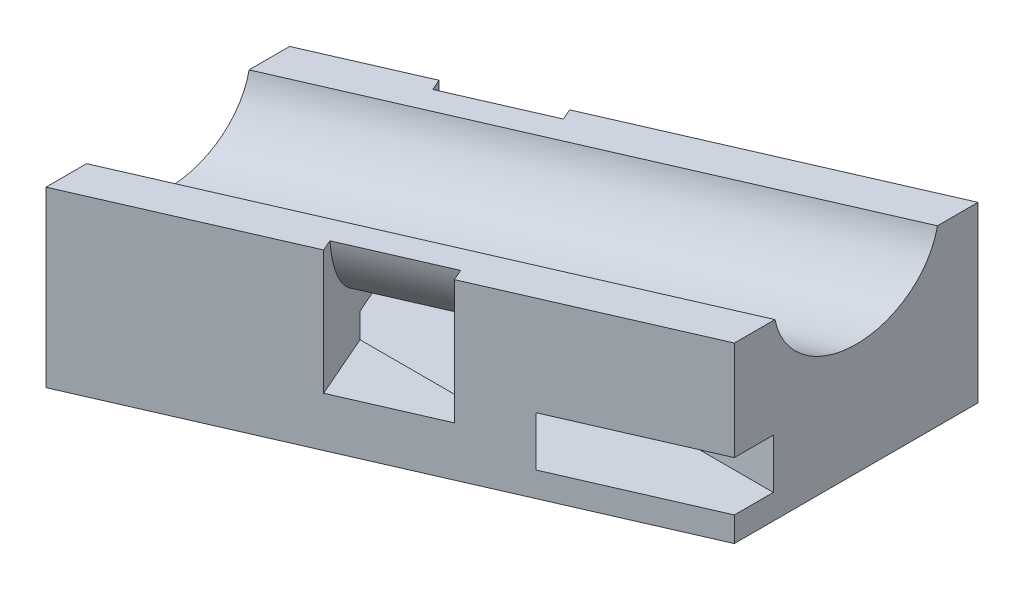
ISO-10303-21;
HEADER;
FILE_DESCRIPTION(('STEP AP214'),'2;1');
FILE_NAME('part.step','',(''),(''),'','','');
FILE_SCHEMA(('AUTOMOTIVE_DESIGN { 1 0 10303 214 1 1 1 1 }'));
ENDSEC;
DATA;
#1=APPLICATION_CONTEXT('core data for automotive mechanical design processes');
#2=APPLICATION_PROTOCOL_DEFINITION('international standard','automotive_design',2000,#1);
#3=PRODUCT_CONTEXT('',#1,'mechanical');
#4=PRODUCT('Part','Part','',(#3));
#5=PRODUCT_RELATED_PRODUCT_CATEGORY('part','',(#4));
#6=PRODUCT_DEFINITION_FORMATION('','',#4);
#7=PRODUCT_DEFINITION_CONTEXT('part definition',#1,'design');
#8=PRODUCT_DEFINITION('design','',#6,#7);
#9=PRODUCT_DEFINITION_SHAPE('','',#8);
#10=(LENGTH_UNIT() NAMED_UNIT(*) SI_UNIT(.MILLI.,.METRE.));
#11=(NAMED_UNIT(*) PLANE_ANGLE_UNIT() SI_UNIT($,.RADIAN.));
#12=(NAMED_UNIT(*) SI_UNIT($,.STERADIAN.) SOLID_ANGLE_UNIT());
#13=UNCERTAINTY_MEASURE_WITH_UNIT(LENGTH_MEASURE(1.E-05),#10,'distance_accuracy_value','');
#14=(GEOMETRIC_REPRESENTATION_CONTEXT(3) GLOBAL_UNCERTAINTY_ASSIGNED_CONTEXT((#13)) GLOBAL_UNIT_ASSIGNED_CONTEXT((#10,
#11,#12)) REPRESENTATION_CONTEXT('',''));
#15=CARTESIAN_POINT('',(0.,0.,0.));
#16=DIRECTION('',(0.,0.,1.));
#17=DIRECTION('',(1.,0.,0.));
#18=AXIS2_PLACEMENT_3D('',#15,#16,#17);
#19=CARTESIAN_POINT('',(0.,7.,0.));
#20=DIRECTION('',(0.,-1.,0.));
#21=DIRECTION('',(0.,0.,-1.));
#22=AXIS2_PLACEMENT_3D('',#19,#20,#21);
#23=PLANE('',#22);
#24=DIRECTION('',(0.,0.,-1.));
#25=VECTOR('',#24,1.);
#26=CARTESIAN_POINT('',(0.,7.,0.));
#27=LINE('',#26,#25);
#28=CARTESIAN_POINT('',(0.,7.,0.));
#29=VERTEX_POINT('',#28);
#30=CARTESIAN_POINT('',(0.,7.,-1.63663417676994));
#31=VERTEX_POINT('',#30);
#32=EDGE_CURVE('E182',#29,#31,#27,.T.);
#33=ORIENTED_EDGE('',*,*,#32,.F.);
#34=DIRECTION('',(0.916515138991168,0.,-0.4));
#35=VECTOR('',#34,1.);
#36=CARTESIAN_POINT('',(22.9128784747792,7.,-10.));
#37=LINE('',#36,#35);
#38=CARTESIAN_POINT('',(7.79037868142493,7.,-3.40000000000001));
#39=VERTEX_POINT('',#38);
#40=EDGE_CURVE('E197',#29,#39,#37,.T.);
#41=ORIENTED_EDGE('',*,*,#40,.T.);
#42=DIRECTION('',(0.4,0.,0.916515138991168));
#43=VECTOR('',#42,1.);
#44=CARTESIAN_POINT('',(7.59537089324404,7.,-3.84681897522243));
#45=LINE('',#44,#43);
#46=CARTESIAN_POINT('',(7.59537089324404,7.,-3.84681897522243));
#47=VERTEX_POINT('',#46);
#48=EDGE_CURVE('E297',#47,#39,#45,.T.);
#49=ORIENTED_EDGE('',*,*,#48,.F.);
#50=DIRECTION('',(0.916515138991168,0.,-0.4));
#51=VECTOR('',#50,1.);
#52=CARTESIAN_POINT('',(7.59537089324404,7.,-3.84681897522243));
#53=LINE('',#52,#51);
#54=CARTESIAN_POINT('',(11.2614314492087,7.,-5.44681897522243));
#55=VERTEX_POINT('',#54);
#56=EDGE_CURVE('E310',#47,#55,#53,.T.);
#57=ORIENTED_EDGE('',*,*,#56,.T.);
#58=DIRECTION('',(0.4,0.,0.916515138991168));
#59=VECTOR('',#58,1.);
#60=CARTESIAN_POINT('',(11.2614314492087,7.,-5.44681897522243));
#61=LINE('',#60,#59);
#62=CARTESIAN_POINT('',(11.4564392373896,7.,-5.00000000000001));
#63=VERTEX_POINT('',#62);
#64=EDGE_CURVE('E313',#55,#63,#61,.T.);
#65=ORIENTED_EDGE('',*,*,#64,.T.);
#66=CARTESIAN_POINT('',(19.3128784747792,7.,-8.42883119030086));
#67=VERTEX_POINT('',#66);
#68=EDGE_CURVE('E210',#63,#67,#37,.T.);
#69=ORIENTED_EDGE('',*,*,#68,.T.);
#70=DIRECTION('',(0.,0.,1.));
#71=VECTOR('',#70,1.);
#72=CARTESIAN_POINT('',(19.3128784747792,7.,-18.2486362509205));
#73=LINE('',#72,#71);
#74=CARTESIAN_POINT('',(19.3128784747792,7.,-10.0654653670708));
#75=VERTEX_POINT('',#74);
#76=EDGE_CURVE('E363',#75,#67,#73,.T.);
#77=ORIENTED_EDGE('',*,*,#76,.F.);
#78=DIRECTION('',(-0.916515138991168,0.,0.4));
#79=VECTOR('',#78,1.);
#80=CARTESIAN_POINT('',(28.2702268782218,7.,-13.9747727084868));
#81=LINE('',#80,#79);
#82=EDGE_CURVE('E200',#75,#31,#81,.T.);
#83=ORIENTED_EDGE('',*,*,#82,.T.);
#84=EDGE_LOOP('',(#33,#41,#49,#57,#65,#69,#77,#83));
#85=FACE_BOUND('',#84,.T.);
#86=ADVANCED_FACE('F33',(#85),#23,.F.);
#87=CARTESIAN_POINT('',(0.,7.,-8.18317088384971));
#88=VERTEX_POINT('',#87);
#89=CARTESIAN_POINT('',(0.,7.,-9.81980506061964));
#90=VERTEX_POINT('',#89);
#91=EDGE_CURVE('E202',#88,#90,#27,.T.);
#92=ORIENTED_EDGE('',*,*,#91,.F.);
#93=DIRECTION('',(-0.916515138991168,0.,0.4));
#94=VECTOR('',#93,1.);
#95=CARTESIAN_POINT('',(25.8702268782218,7.,-19.4738635424338));
#96=LINE('',#95,#94);
#97=CARTESIAN_POINT('',(19.3128784747792,7.,-16.6120020741506));
#98=VERTEX_POINT('',#97);
#99=EDGE_CURVE('E222',#98,#88,#96,.T.);
#100=ORIENTED_EDGE('',*,*,#99,.F.);
#101=CARTESIAN_POINT('',(19.3128784747792,7.,-18.2486362509205));
#102=VERTEX_POINT('',#101);
#103=EDGE_CURVE('E348',#102,#98,#73,.T.);
#104=ORIENTED_EDGE('',*,*,#103,.F.);
#105=DIRECTION('',(-0.916515138991168,0.,0.4));
#106=VECTOR('',#105,1.);
#107=CARTESIAN_POINT('',(-3.6,7.,-8.2486362509205));
#108=LINE('',#107,#106);
#109=CARTESIAN_POINT('',(7.85643923738961,7.,-13.2486362509205));
#110=VERTEX_POINT('',#109);
#111=EDGE_CURVE('E191',#102,#110,#108,.T.);
#112=ORIENTED_EDGE('',*,*,#111,.T.);
#113=DIRECTION('',(0.400000000000001,0.,0.916515138991168));
#114=VECTOR('',#113,1.);
#115=CARTESIAN_POINT('',(8.05144702557049,7.,-12.8018172756981));
#116=LINE('',#115,#114);
#117=CARTESIAN_POINT('',(8.05144702557049,7.,-12.8018172756981));
#118=VERTEX_POINT('',#117);
#119=EDGE_CURVE('E298',#110,#118,#116,.T.);
#120=ORIENTED_EDGE('',*,*,#119,.T.);
#121=DIRECTION('',(0.916515138991168,0.,-0.4));
#122=VECTOR('',#121,1.);
#123=CARTESIAN_POINT('',(4.38538646960582,7.,-11.2018172756981));
#124=LINE('',#123,#122);
#125=CARTESIAN_POINT('',(4.38538646960582,7.,-11.2018172756981));
#126=VERTEX_POINT('',#125);
#127=EDGE_CURVE('E328',#126,#118,#124,.T.);
#128=ORIENTED_EDGE('',*,*,#127,.F.);
#129=DIRECTION('',(0.400000000000001,0.,0.916515138991168));
#130=VECTOR('',#129,1.);
#131=CARTESIAN_POINT('',(4.38538646960582,7.,-11.2018172756981));
#132=LINE('',#131,#130);
#133=CARTESIAN_POINT('',(4.19037868142494,7.,-11.6486362509205));
#134=VERTEX_POINT('',#133);
#135=EDGE_CURVE('E307',#134,#126,#132,.T.);
#136=ORIENTED_EDGE('',*,*,#135,.F.);
#137=EDGE_CURVE('E209',#134,#90,#108,.T.);
#138=ORIENTED_EDGE('',*,*,#137,.T.);
#139=EDGE_LOOP('',(#92,#100,#104,#112,#120,#128,#136,#138));
#140=FACE_BOUND('',#139,.T.);
#141=ADVANCED_FACE('F347',(#140),#23,.F.);
#142=CARTESIAN_POINT('',(0.,0.,0.));
#143=DIRECTION('',(0.,-1.,0.));
#144=DIRECTION('',(0.,0.,-1.));
#145=AXIS2_PLACEMENT_3D('',#142,#143,#144);
#146=PLANE('',#145);
#147=DIRECTION('',(0.916515138991168,0.,-0.4));
#148=VECTOR('',#147,1.);
#149=CARTESIAN_POINT('',(22.9128784747792,0.,-10.));
#150=LINE('',#149,#148);
#151=CARTESIAN_POINT('',(0.,0.,0.));
#152=VERTEX_POINT('',#151);
#153=CARTESIAN_POINT('',(19.3128784747792,0.,-8.42883119030086));
#154=VERTEX_POINT('',#153);
#155=EDGE_CURVE('E220',#152,#154,#150,.T.);
#156=ORIENTED_EDGE('',*,*,#155,.F.);
#157=DIRECTION('',(0.,0.,-1.));
#158=VECTOR('',#157,1.);
#159=CARTESIAN_POINT('',(0.,0.,0.));
#160=LINE('',#159,#158);
#161=CARTESIAN_POINT('',(0.,0.,-9.81980506061964));
#162=VERTEX_POINT('',#161);
#163=EDGE_CURVE('E185',#152,#162,#160,.T.);
#164=ORIENTED_EDGE('',*,*,#163,.T.);
#165=DIRECTION('',(-0.916515138991168,0.,0.4));
#166=VECTOR('',#165,1.);
#167=CARTESIAN_POINT('',(-3.6,0.,-8.2486362509205));
#168=LINE('',#167,#166);
#169=CARTESIAN_POINT('',(19.3128784747792,0.,-18.2486362509205));
#170=VERTEX_POINT('',#169);
#171=EDGE_CURVE('E215',#170,#162,#168,.T.);
#172=ORIENTED_EDGE('',*,*,#171,.F.);
#173=DIRECTION('',(0.,0.,1.));
#174=VECTOR('',#173,1.);
#175=CARTESIAN_POINT('',(19.3128784747792,0.,-18.2486362509205));
#176=LINE('',#175,#174);
#177=EDGE_CURVE('E360',#170,#154,#176,.T.);
#178=ORIENTED_EDGE('',*,*,#177,.T.);
#179=EDGE_LOOP('',(#156,#164,#172,#178));
#180=FACE_BOUND('',#179,.T.);
#181=ADVANCED_FACE('F400',(#180),#146,.T.);
#182=CARTESIAN_POINT('',(27.0702268782218,7.54999999999999,-16.7243181254603));
#183=DIRECTION('',(-0.916515138991168,0.,0.4));
#184=DIRECTION('',(0.4,0.,0.916515138991168));
#185=AXIS2_PLACEMENT_3D('',#182,#183,#184);
#186=CYLINDRICAL_SURFACE('',#185,3.04999999999999);
#187=CARTESIAN_POINT('',(0.,7.54999999999999,-4.90990253030982));
#188=DIRECTION('',(-1.,0.,0.));
#189=DIRECTION('',(0.,0.,1.));
#190=AXIS2_PLACEMENT_3D('',#187,#188,#189);
#191=ELLIPSE('',#190,3.32782282609888,3.04999999999999);
#192=EDGE_CURVE('E343',#31,#88,#191,.F.);
#193=ORIENTED_EDGE('',*,*,#192,.F.);
#194=ORIENTED_EDGE('',*,*,#82,.F.);
#195=CARTESIAN_POINT('',(19.3128784747792,7.54999999999999,-13.3387337206107));
#196=DIRECTION('',(1.,0.,0.));
#197=DIRECTION('',(0.,0.,1.));
#198=AXIS2_PLACEMENT_3D('',#195,#196,#197);
#199=ELLIPSE('',#198,3.32782282609888,3.04999999999999);
#200=EDGE_CURVE('E249',#98,#75,#199,.F.);
#201=ORIENTED_EDGE('',*,*,#200,.F.);
#202=ORIENTED_EDGE('',*,*,#99,.T.);
#203=EDGE_LOOP('',(#193,#194,#201,#202));
#204=FACE_BOUND('',#203,.T.);
#205=ADVANCED_FACE('F342',(#204),#186,.F.);
#206=CARTESIAN_POINT('',(-3.6,1.,-6.));
#207=DIRECTION('',(0.,-1.,0.));
#208=DIRECTION('',(0.,0.,-1.));
#209=AXIS2_PLACEMENT_3D('',#206,#207,#208);
#210=PLANE('',#209);
#211=DIRECTION('',(0.,0.,-1.));
#212=VECTOR('',#211,1.);
#213=CARTESIAN_POINT('',(0.,1.,-6.));
#214=LINE('',#213,#212);
#215=CARTESIAN_POINT('',(0.,1.,-6.));
#216=VERTEX_POINT('',#215);
#217=CARTESIAN_POINT('',(0.,1.,-9.81980506061964));
#218=VERTEX_POINT('',#217);
#219=EDGE_CURVE('E357',#216,#218,#214,.T.);
#220=ORIENTED_EDGE('',*,*,#219,.F.);
#221=DIRECTION('',(1.,0.,0.));
#222=VECTOR('',#221,1.);
#223=CARTESIAN_POINT('',(-3.6,1.,-6.));
#224=LINE('',#223,#222);
#225=CARTESIAN_POINT('',(13.7477270848675,1.,-6.));
#226=VERTEX_POINT('',#225);
#227=EDGE_CURVE('E257',#216,#226,#224,.T.);
#228=ORIENTED_EDGE('',*,*,#227,.T.);
#229=DIRECTION('',(-0.916515138991168,0.,0.4));
#230=VECTOR('',#229,1.);
#231=CARTESIAN_POINT('',(22.9128784747792,1.,-10.));
#232=LINE('',#231,#230);
#233=CARTESIAN_POINT('',(19.3128784747792,1.,-8.42883119030086));
#234=VERTEX_POINT('',#233);
#235=EDGE_CURVE('E248',#234,#226,#232,.T.);
#236=ORIENTED_EDGE('',*,*,#235,.F.);
#237=DIRECTION('',(0.,0.,1.));
#238=VECTOR('',#237,1.);
#239=CARTESIAN_POINT('',(19.3128784747792,1.,-6.));
#240=LINE('',#239,#238);
#241=CARTESIAN_POINT('',(19.3128784747792,1.,-10.));
#242=VERTEX_POINT('',#241);
#243=EDGE_CURVE('E235',#242,#234,#240,.T.);
#244=ORIENTED_EDGE('',*,*,#243,.F.);
#245=DIRECTION('',(1.,0.,0.));
#246=VECTOR('',#245,1.);
#247=CARTESIAN_POINT('',(-3.6,1.,-10.));
#248=LINE('',#247,#246);
#249=CARTESIAN_POINT('',(0.412878474779229,1.,-10.));
#250=VERTEX_POINT('',#249);
#251=EDGE_CURVE('E246',#250,#242,#248,.T.);
#252=ORIENTED_EDGE('',*,*,#251,.F.);
#253=DIRECTION('',(0.916515138991168,0.,-0.4));
#254=VECTOR('',#253,1.);
#255=CARTESIAN_POINT('',(-3.6,0.999999999999999,-8.2486362509205));
#256=LINE('',#255,#254);
#257=EDGE_CURVE('E290',#218,#250,#256,.T.);
#258=ORIENTED_EDGE('',*,*,#257,.F.);
#259=EDGE_LOOP('',(#220,#228,#236,#244,#252,#258));
#260=FACE_BOUND('',#259,.T.);
#261=ADVANCED_FACE('F244',(#260),#210,.F.);
#262=CARTESIAN_POINT('',(-3.6,7.,-8.2486362509205));
#263=DIRECTION('',(0.4,0.,0.916515138991168));
#264=DIRECTION('',(0.916515138991168,0.,-0.4));
#265=AXIS2_PLACEMENT_3D('',#262,#263,#264);
#266=PLANE('',#265);
#267=DIRECTION('',(0.,-1.,0.));
#268=VECTOR('',#267,1.);
#269=CARTESIAN_POINT('',(0.,7.,-9.81980506061964));
#270=LINE('',#269,#268);
#271=CARTESIAN_POINT('',(0.,3.,-9.81980506061964));
#272=VERTEX_POINT('',#271);
#273=EDGE_CURVE('E47',#90,#272,#270,.T.);
#274=ORIENTED_EDGE('',*,*,#273,.F.);
#275=ORIENTED_EDGE('',*,*,#137,.F.);
#276=DIRECTION('',(0.,1.,0.));
#277=VECTOR('',#276,1.);
#278=CARTESIAN_POINT('',(4.19037868142494,7.,-11.6486362509205));
#279=LINE('',#278,#277);
#280=CARTESIAN_POINT('',(4.19037868142494,1.99999999999999,-11.6486362509205));
#281=VERTEX_POINT('',#280);
#282=EDGE_CURVE('E305',#281,#134,#279,.T.);
#283=ORIENTED_EDGE('',*,*,#282,.F.);
#284=DIRECTION('',(0.916515138991168,0.,-0.4));
#285=VECTOR('',#284,1.);
#286=CARTESIAN_POINT('',(4.19037868142494,1.99999999999999,-11.6486362509205));
#287=LINE('',#286,#285);
#288=CARTESIAN_POINT('',(7.85643923738961,1.99999999999999,-13.2486362509205));
#289=VERTEX_POINT('',#288);
#290=EDGE_CURVE('E331',#281,#289,#287,.T.);
#291=ORIENTED_EDGE('',*,*,#290,.T.);
#292=DIRECTION('',(0.,1.,0.));
#293=VECTOR('',#292,1.);
#294=CARTESIAN_POINT('',(7.85643923738961,7.,-13.2486362509205));
#295=LINE('',#294,#293);
#296=EDGE_CURVE('E323',#289,#110,#295,.T.);
#297=ORIENTED_EDGE('',*,*,#296,.T.);
#298=ORIENTED_EDGE('',*,*,#111,.F.);
#299=DIRECTION('',(0.,-1.,0.));
#300=VECTOR('',#299,1.);
#301=CARTESIAN_POINT('',(19.3128784747792,7.,-18.2486362509205));
#302=LINE('',#301,#300);
#303=EDGE_CURVE('E190',#102,#170,#302,.T.);
#304=ORIENTED_EDGE('',*,*,#303,.T.);
#305=ORIENTED_EDGE('',*,*,#171,.T.);
#306=EDGE_CURVE('E201',#218,#162,#270,.T.);
#307=ORIENTED_EDGE('',*,*,#306,.F.);
#308=ORIENTED_EDGE('',*,*,#257,.T.);
#309=DIRECTION('',(0.,1.,0.));
#310=VECTOR('',#309,1.);
#311=CARTESIAN_POINT('',(0.412878474779228,7.,-10.));
#312=LINE('',#311,#310);
#313=CARTESIAN_POINT('',(0.412878474779227,3.,-10.));
#314=VERTEX_POINT('',#313);
#315=EDGE_CURVE('E255',#250,#314,#312,.T.);
#316=ORIENTED_EDGE('',*,*,#315,.T.);
#317=DIRECTION('',(-0.916515138991168,0.,0.4));
#318=VECTOR('',#317,1.);
#319=CARTESIAN_POINT('',(-3.6,3.,-8.2486362509205));
#320=LINE('',#319,#318);
#321=EDGE_CURVE('E275',#314,#272,#320,.T.);
#322=ORIENTED_EDGE('',*,*,#321,.T.);
#323=EDGE_LOOP('',(#274,#275,#283,#291,#297,#298,#304,#305,#307,#308,#316,#322));
#324=FACE_BOUND('',#323,.T.);
#325=ADVANCED_FACE('F397',(#324),#266,.F.);
#326=CARTESIAN_POINT('',(-3.6,1.,-6.));
#327=DIRECTION('',(0.,0.,1.));
#328=DIRECTION('',(1.,0.,0.));
#329=AXIS2_PLACEMENT_3D('',#326,#327,#328);
#330=PLANE('',#329);
#331=DIRECTION('',(0.,-1.,0.));
#332=VECTOR('',#331,1.);
#333=CARTESIAN_POINT('',(0.,1.,-6.));
#334=LINE('',#333,#332);
#335=CARTESIAN_POINT('',(0.,3.,-6.));
#336=VERTEX_POINT('',#335);
#337=EDGE_CURVE('E355',#336,#216,#334,.T.);
#338=ORIENTED_EDGE('',*,*,#337,.F.);
#339=DIRECTION('',(1.,0.,0.));
#340=VECTOR('',#339,1.);
#341=CARTESIAN_POINT('',(-3.6,3.,-6.));
#342=LINE('',#341,#340);
#343=CARTESIAN_POINT('',(6.65564565219777,3.,-6.));
#344=VERTEX_POINT('',#343);
#345=EDGE_CURVE('E268',#336,#344,#342,.T.);
#346=ORIENTED_EDGE('',*,*,#345,.T.);
#347=DIRECTION('',(0.,1.,0.));
#348=VECTOR('',#347,1.);
#349=CARTESIAN_POINT('',(6.65564565219777,7.54999999999999,-6.));
#350=LINE('',#349,#348);
#351=CARTESIAN_POINT('',(6.65564565219777,1.99999999999999,-6.));
#352=VERTEX_POINT('',#351);
#353=EDGE_CURVE('E284',#352,#344,#350,.T.);
#354=ORIENTED_EDGE('',*,*,#353,.F.);
#355=DIRECTION('',(-1.,0.,0.));
#356=VECTOR('',#355,1.);
#357=CARTESIAN_POINT('',(7.79037868142493,1.99999999999999,-6.));
#358=LINE('',#357,#356);
#359=CARTESIAN_POINT('',(11.0200034569176,1.99999999999999,-6.));
#360=VERTEX_POINT('',#359);
#361=EDGE_CURVE('E281',#360,#352,#358,.T.);
#362=ORIENTED_EDGE('',*,*,#361,.F.);
#363=DIRECTION('',(0.,1.,0.));
#364=VECTOR('',#363,1.);
#365=CARTESIAN_POINT('',(11.0200034569176,7.54999999999999,-6.));
#366=LINE('',#365,#364);
#367=CARTESIAN_POINT('',(11.0200034569176,3.,-6.));
#368=VERTEX_POINT('',#367);
#369=EDGE_CURVE('E232',#360,#368,#366,.T.);
#370=ORIENTED_EDGE('',*,*,#369,.T.);
#371=CARTESIAN_POINT('',(13.7477270848675,3.,-6.));
#372=VERTEX_POINT('',#371);
#373=EDGE_CURVE('E369',#368,#372,#342,.T.);
#374=ORIENTED_EDGE('',*,*,#373,.T.);
#375=DIRECTION('',(0.,1.,0.));
#376=VECTOR('',#375,1.);
#377=CARTESIAN_POINT('',(13.7477270848675,7.,-6.));
#378=LINE('',#377,#376);
#379=EDGE_CURVE('E287',#226,#372,#378,.T.);
#380=ORIENTED_EDGE('',*,*,#379,.F.);
#381=ORIENTED_EDGE('',*,*,#227,.F.);
#382=EDGE_LOOP('',(#338,#346,#354,#362,#370,#374,#380,#381));
#383=FACE_BOUND('',#382,.T.);
#384=ADVANCED_FACE('F383',(#383),#330,.F.);
#385=CARTESIAN_POINT('',(-3.6,3.,-6.));
#386=DIRECTION('',(0.,1.,0.));
#387=DIRECTION('',(0.,0.,1.));
#388=AXIS2_PLACEMENT_3D('',#385,#386,#387);
#389=PLANE('',#388);
#390=DIRECTION('',(0.,0.,1.));
#391=VECTOR('',#390,1.);
#392=CARTESIAN_POINT('',(0.,3.,-6.));
#393=LINE('',#392,#391);
#394=EDGE_CURVE('E11',#272,#336,#393,.T.);
#395=ORIENTED_EDGE('',*,*,#394,.F.);
#396=ORIENTED_EDGE('',*,*,#321,.F.);
#397=DIRECTION('',(1.,0.,0.));
#398=VECTOR('',#397,1.);
#399=CARTESIAN_POINT('',(-3.6,3.,-10.));
#400=LINE('',#399,#398);
#401=CARTESIAN_POINT('',(4.90990253030983,3.,-10.));
#402=VERTEX_POINT('',#401);
#403=EDGE_CURVE('E259',#314,#402,#400,.T.);
#404=ORIENTED_EDGE('',*,*,#403,.T.);
#405=DIRECTION('',(-0.4,0.,-0.916515138991168));
#406=VECTOR('',#405,1.);
#407=CARTESIAN_POINT('',(5.99037868142493,3.,-7.52431812546026));
#408=LINE('',#407,#406);
#409=EDGE_CURVE('E272',#344,#402,#408,.T.);
#410=ORIENTED_EDGE('',*,*,#409,.F.);
#411=ORIENTED_EDGE('',*,*,#345,.F.);
#412=EDGE_LOOP('',(#395,#396,#404,#410,#411));
#413=FACE_BOUND('',#412,.T.);
#414=ADVANCED_FACE('F377',(#413),#389,.F.);
#415=CARTESIAN_POINT('',(22.9128784747792,7.,-10.));
#416=DIRECTION('',(-0.4,0.,-0.916515138991168));
#417=DIRECTION('',(-0.916515138991168,0.,0.4));
#418=AXIS2_PLACEMENT_3D('',#415,#416,#417);
#419=PLANE('',#418);
#420=DIRECTION('',(0.,-1.,0.));
#421=VECTOR('',#420,1.);
#422=CARTESIAN_POINT('',(19.3128784747792,7.,-8.42883119030086));
#423=LINE('',#422,#421);
#424=CARTESIAN_POINT('',(19.3128784747792,3.,-8.42883119030086));
#425=VERTEX_POINT('',#424);
#426=EDGE_CURVE('E366',#67,#425,#423,.T.);
#427=ORIENTED_EDGE('',*,*,#426,.F.);
#428=ORIENTED_EDGE('',*,*,#68,.F.);
#429=DIRECTION('',(0.,-1.,0.));
#430=VECTOR('',#429,1.);
#431=CARTESIAN_POINT('',(11.4564392373896,7.,-5.00000000000001));
#432=LINE('',#431,#430);
#433=CARTESIAN_POINT('',(11.4564392373896,1.99999999999999,-5.));
#434=VERTEX_POINT('',#433);
#435=EDGE_CURVE('E316',#63,#434,#432,.T.);
#436=ORIENTED_EDGE('',*,*,#435,.T.);
#437=DIRECTION('',(0.916515138991168,0.,-0.4));
#438=VECTOR('',#437,1.);
#439=CARTESIAN_POINT('',(7.79037868142493,1.99999999999999,-3.40000000000001));
#440=LINE('',#439,#438);
#441=CARTESIAN_POINT('',(7.79037868142493,1.99999999999999,-3.40000000000001));
#442=VERTEX_POINT('',#441);
#443=EDGE_CURVE('E334',#442,#434,#440,.T.);
#444=ORIENTED_EDGE('',*,*,#443,.F.);
#445=DIRECTION('',(0.,-1.,0.));
#446=VECTOR('',#445,1.);
#447=CARTESIAN_POINT('',(7.79037868142493,7.,-3.40000000000001));
#448=LINE('',#447,#446);
#449=EDGE_CURVE('E208',#39,#442,#448,.T.);
#450=ORIENTED_EDGE('',*,*,#449,.F.);
#451=ORIENTED_EDGE('',*,*,#40,.F.);
#452=DIRECTION('',(0.,-1.,0.));
#453=VECTOR('',#452,1.);
#454=CARTESIAN_POINT('',(0.,7.,0.));
#455=LINE('',#454,#453);
#456=EDGE_CURVE('E179',#29,#152,#455,.T.);
#457=ORIENTED_EDGE('',*,*,#456,.T.);
#458=ORIENTED_EDGE('',*,*,#155,.T.);
#459=EDGE_CURVE('E362',#234,#154,#423,.T.);
#460=ORIENTED_EDGE('',*,*,#459,.F.);
#461=ORIENTED_EDGE('',*,*,#235,.T.);
#462=ORIENTED_EDGE('',*,*,#379,.T.);
#463=DIRECTION('',(0.916515138991168,0.,-0.4));
#464=VECTOR('',#463,1.);
#465=CARTESIAN_POINT('',(22.9128784747792,3.,-10.));
#466=LINE('',#465,#464);
#467=EDGE_CURVE('E278',#372,#425,#466,.T.);
#468=ORIENTED_EDGE('',*,*,#467,.T.);
#469=EDGE_LOOP('',(#427,#428,#436,#444,#450,#451,#457,#458,#460,#461,#462,#468));
#470=FACE_BOUND('',#469,.T.);
#471=ADVANCED_FACE('F35',(#470),#419,.F.);
#472=DIRECTION('',(0.,0.,-1.));
#473=VECTOR('',#472,1.);
#474=CARTESIAN_POINT('',(19.3128784747792,3.,-6.));
#475=LINE('',#474,#473);
#476=CARTESIAN_POINT('',(19.3128784747792,3.,-10.));
#477=VERTEX_POINT('',#476);
#478=EDGE_CURVE('E55',#425,#477,#475,.T.);
#479=ORIENTED_EDGE('',*,*,#478,.F.);
#480=ORIENTED_EDGE('',*,*,#467,.F.);
#481=ORIENTED_EDGE('',*,*,#373,.F.);
#482=DIRECTION('',(-0.4,0.,-0.916515138991168));
#483=VECTOR('',#482,1.);
#484=CARTESIAN_POINT('',(9.6564392373896,3.,-9.12431812546026));
#485=LINE('',#484,#483);
#486=CARTESIAN_POINT('',(9.27426033502968,3.,-10.));
#487=VERTEX_POINT('',#486);
#488=EDGE_CURVE('E229',#368,#487,#485,.T.);
#489=ORIENTED_EDGE('',*,*,#488,.T.);
#490=EDGE_CURVE('E256',#487,#477,#400,.T.);
#491=ORIENTED_EDGE('',*,*,#490,.T.);
#492=EDGE_LOOP('',(#479,#480,#481,#489,#491));
#493=FACE_BOUND('',#492,.T.);
#494=ADVANCED_FACE('F392',(#493),#389,.F.);
#495=CARTESIAN_POINT('',(-3.6,1.,-10.));
#496=DIRECTION('',(0.,0.,-1.));
#497=DIRECTION('',(-1.,0.,0.));
#498=AXIS2_PLACEMENT_3D('',#495,#496,#497);
#499=PLANE('',#498);
#500=DIRECTION('',(0.,-1.,0.));
#501=VECTOR('',#500,1.);
#502=CARTESIAN_POINT('',(19.3128784747792,1.,-10.));
#503=LINE('',#502,#501);
#504=EDGE_CURVE('E41',#477,#242,#503,.T.);
#505=ORIENTED_EDGE('',*,*,#504,.F.);
#506=ORIENTED_EDGE('',*,*,#490,.F.);
#507=DIRECTION('',(0.,-1.,0.));
#508=VECTOR('',#507,1.);
#509=CARTESIAN_POINT('',(9.27426033502968,7.54999999999999,-10.));
#510=LINE('',#509,#508);
#511=CARTESIAN_POINT('',(9.27426033502968,1.99999999999999,-10.));
#512=VERTEX_POINT('',#511);
#513=EDGE_CURVE('E227',#487,#512,#510,.T.);
#514=ORIENTED_EDGE('',*,*,#513,.T.);
#515=DIRECTION('',(1.,0.,0.));
#516=VECTOR('',#515,1.);
#517=CARTESIAN_POINT('',(7.79037868142493,1.99999999999999,-10.));
#518=LINE('',#517,#516);
#519=CARTESIAN_POINT('',(4.90990253030983,1.99999999999999,-10.));
#520=VERTEX_POINT('',#519);
#521=EDGE_CURVE('E264',#520,#512,#518,.T.);
#522=ORIENTED_EDGE('',*,*,#521,.F.);
#523=DIRECTION('',(0.,-1.,0.));
#524=VECTOR('',#523,1.);
#525=CARTESIAN_POINT('',(4.90990253030983,7.54999999999999,-10.));
#526=LINE('',#525,#524);
#527=EDGE_CURVE('E267',#402,#520,#526,.T.);
#528=ORIENTED_EDGE('',*,*,#527,.F.);
#529=ORIENTED_EDGE('',*,*,#403,.F.);
#530=ORIENTED_EDGE('',*,*,#315,.F.);
#531=ORIENTED_EDGE('',*,*,#251,.T.);
#532=EDGE_LOOP('',(#505,#506,#514,#522,#528,#529,#530,#531));
#533=FACE_BOUND('',#532,.T.);
#534=ADVANCED_FACE('F252',(#533),#499,.F.);
#535=CARTESIAN_POINT('',(7.79037868142493,1.99999999999999,-3.40000000000001));
#536=DIRECTION('',(0.,-1.,0.));
#537=DIRECTION('',(0.,0.,-1.));
#538=AXIS2_PLACEMENT_3D('',#535,#536,#537);
#539=PLANE('',#538);
#540=DIRECTION('',(-0.4,0.,-0.916515138991168));
#541=VECTOR('',#540,1.);
#542=CARTESIAN_POINT('',(11.4564392373896,1.99999999999999,-5.00000000000001));
#543=LINE('',#542,#541);
#544=EDGE_CURVE('E320',#434,#360,#543,.T.);
#545=ORIENTED_EDGE('',*,*,#544,.T.);
#546=ORIENTED_EDGE('',*,*,#361,.T.);
#547=DIRECTION('',(-0.4,0.,-0.916515138991168));
#548=VECTOR('',#547,1.);
#549=CARTESIAN_POINT('',(7.79037868142493,1.99999999999999,-3.40000000000001));
#550=LINE('',#549,#548);
#551=EDGE_CURVE('E302',#442,#352,#550,.T.);
#552=ORIENTED_EDGE('',*,*,#551,.F.);
#553=ORIENTED_EDGE('',*,*,#443,.T.);
#554=EDGE_LOOP('',(#545,#546,#552,#553));
#555=FACE_BOUND('',#554,.T.);
#556=ADVANCED_FACE('F386',(#555),#539,.F.);
#557=CARTESIAN_POINT('',(5.99037868142493,7.54999999999999,-7.52431812546026));
#558=DIRECTION('',(0.916515138991168,0.,-0.4));
#559=DIRECTION('',(-0.4,0.,-0.916515138991168));
#560=AXIS2_PLACEMENT_3D('',#557,#558,#559);
#561=CYLINDRICAL_SURFACE('',#560,4.05);
#562=CARTESIAN_POINT('',(9.6564392373896,7.54999999999999,-9.12431812546026));
#563=DIRECTION('',(-0.916515138991168,0.,0.4));
#564=DIRECTION('',(0.4,0.,0.916515138991168));
#565=AXIS2_PLACEMENT_3D('',#562,#563,#564);
#566=CIRCLE('',#565,4.05);
#567=EDGE_CURVE('E293',#118,#55,#566,.T.);
#568=ORIENTED_EDGE('',*,*,#567,.T.);
#569=ORIENTED_EDGE('',*,*,#56,.F.);
#570=CARTESIAN_POINT('',(5.99037868142493,7.54999999999999,-7.52431812546026));
#571=DIRECTION('',(-0.916515138991168,0.,0.4));
#572=DIRECTION('',(0.4,0.,0.916515138991168));
#573=AXIS2_PLACEMENT_3D('',#570,#571,#572);
#574=CIRCLE('',#573,4.05);
#575=EDGE_CURVE('E294',#126,#47,#574,.T.);
#576=ORIENTED_EDGE('',*,*,#575,.F.);
#577=ORIENTED_EDGE('',*,*,#127,.T.);
#578=EDGE_LOOP('',(#568,#569,#576,#577));
#579=FACE_BOUND('',#578,.T.);
#580=ADVANCED_FACE('F402',(#579),#561,.T.);
#581=EDGE_CURVE('E301',#520,#281,#550,.T.);
#582=ORIENTED_EDGE('',*,*,#581,.F.);
#583=ORIENTED_EDGE('',*,*,#521,.T.);
#584=EDGE_CURVE('E319',#512,#289,#543,.T.);
#585=ORIENTED_EDGE('',*,*,#584,.T.);
#586=ORIENTED_EDGE('',*,*,#290,.F.);
#587=EDGE_LOOP('',(#582,#583,#585,#586));
#588=FACE_BOUND('',#587,.T.);
#589=ADVANCED_FACE('F409',(#588),#539,.F.);
#590=CARTESIAN_POINT('',(5.99037868142493,7.54999999999999,-7.52431812546026));
#591=DIRECTION('',(-0.916515138991168,0.,0.4));
#592=DIRECTION('',(0.4,0.,0.916515138991168));
#593=AXIS2_PLACEMENT_3D('',#590,#591,#592);
#594=PLANE('',#593);
#595=ORIENTED_EDGE('',*,*,#551,.T.);
#596=ORIENTED_EDGE('',*,*,#353,.T.);
#597=ORIENTED_EDGE('',*,*,#409,.T.);
#598=ORIENTED_EDGE('',*,*,#527,.T.);
#599=ORIENTED_EDGE('',*,*,#581,.T.);
#600=ORIENTED_EDGE('',*,*,#282,.T.);
#601=ORIENTED_EDGE('',*,*,#135,.T.);
#602=ORIENTED_EDGE('',*,*,#575,.T.);
#603=ORIENTED_EDGE('',*,*,#48,.T.);
#604=ORIENTED_EDGE('',*,*,#449,.T.);
#605=EDGE_LOOP('',(#595,#596,#597,#598,#599,#600,#601,#602,#603,#604));
#606=FACE_BOUND('',#605,.T.);
#607=ADVANCED_FACE('F380',(#606),#594,.F.);
#608=CARTESIAN_POINT('',(9.6564392373896,7.54999999999999,-9.12431812546026));
#609=DIRECTION('',(-0.916515138991168,0.,0.4));
#610=DIRECTION('',(0.4,0.,0.916515138991168));
#611=AXIS2_PLACEMENT_3D('',#608,#609,#610);
#612=PLANE('',#611);
#613=ORIENTED_EDGE('',*,*,#369,.F.);
#614=ORIENTED_EDGE('',*,*,#544,.F.);
#615=ORIENTED_EDGE('',*,*,#435,.F.);
#616=ORIENTED_EDGE('',*,*,#64,.F.);
#617=ORIENTED_EDGE('',*,*,#567,.F.);
#618=ORIENTED_EDGE('',*,*,#119,.F.);
#619=ORIENTED_EDGE('',*,*,#296,.F.);
#620=ORIENTED_EDGE('',*,*,#584,.F.);
#621=ORIENTED_EDGE('',*,*,#513,.F.);
#622=ORIENTED_EDGE('',*,*,#488,.F.);
#623=EDGE_LOOP('',(#613,#614,#615,#616,#617,#618,#619,#620,#621,#622));
#624=FACE_BOUND('',#623,.T.);
#625=ADVANCED_FACE('F388',(#624),#612,.T.);
#626=CARTESIAN_POINT('',(19.3128784747792,7.,-18.2486362509205));
#627=DIRECTION('',(1.,0.,0.));
#628=DIRECTION('',(0.,0.,-1.));
#629=AXIS2_PLACEMENT_3D('',#626,#627,#628);
#630=PLANE('',#629);
#631=ORIENTED_EDGE('',*,*,#200,.T.);
#632=ORIENTED_EDGE('',*,*,#76,.T.);
#633=ORIENTED_EDGE('',*,*,#426,.T.);
#634=ORIENTED_EDGE('',*,*,#478,.T.);
#635=ORIENTED_EDGE('',*,*,#504,.T.);
#636=ORIENTED_EDGE('',*,*,#243,.T.);
#637=ORIENTED_EDGE('',*,*,#459,.T.);
#638=ORIENTED_EDGE('',*,*,#177,.F.);
#639=ORIENTED_EDGE('',*,*,#303,.F.);
#640=ORIENTED_EDGE('',*,*,#103,.T.);
#641=EDGE_LOOP('',(#631,#632,#633,#634,#635,#636,#637,#638,#639,#640));
#642=FACE_BOUND('',#641,.T.);
#643=ADVANCED_FACE('F234',(#642),#630,.T.);
#644=CARTESIAN_POINT('',(0.,7.,0.));
#645=DIRECTION('',(-1.,0.,0.));
#646=DIRECTION('',(0.,0.,1.));
#647=AXIS2_PLACEMENT_3D('',#644,#645,#646);
#648=PLANE('',#647);
#649=ORIENTED_EDGE('',*,*,#192,.T.);
#650=ORIENTED_EDGE('',*,*,#91,.T.);
#651=ORIENTED_EDGE('',*,*,#273,.T.);
#652=ORIENTED_EDGE('',*,*,#394,.T.);
#653=ORIENTED_EDGE('',*,*,#337,.T.);
#654=ORIENTED_EDGE('',*,*,#219,.T.);
#655=ORIENTED_EDGE('',*,*,#306,.T.);
#656=ORIENTED_EDGE('',*,*,#163,.F.);
#657=ORIENTED_EDGE('',*,*,#456,.F.);
#658=ORIENTED_EDGE('',*,*,#32,.T.);
#659=EDGE_LOOP('',(#649,#650,#651,#652,#653,#654,#655,#656,#657,#658));
#660=FACE_BOUND('',#659,.T.);
#661=ADVANCED_FACE('F181',(#660),#648,.T.);
#662=CLOSED_SHELL('',(#86,#141,#181,#205,#261,#325,#384,#414,#471,#494,#534,#556,#580,#589,#607,
#625,#643,#661));
#663=MANIFOLD_SOLID_BREP('B2',#662);
#664=ADVANCED_BREP_SHAPE_REPRESENTATION('',(#18,#663),#14);
#665=SHAPE_DEFINITION_REPRESENTATION(#9,#664);
ENDSEC;
END-ISO-10303-21;
